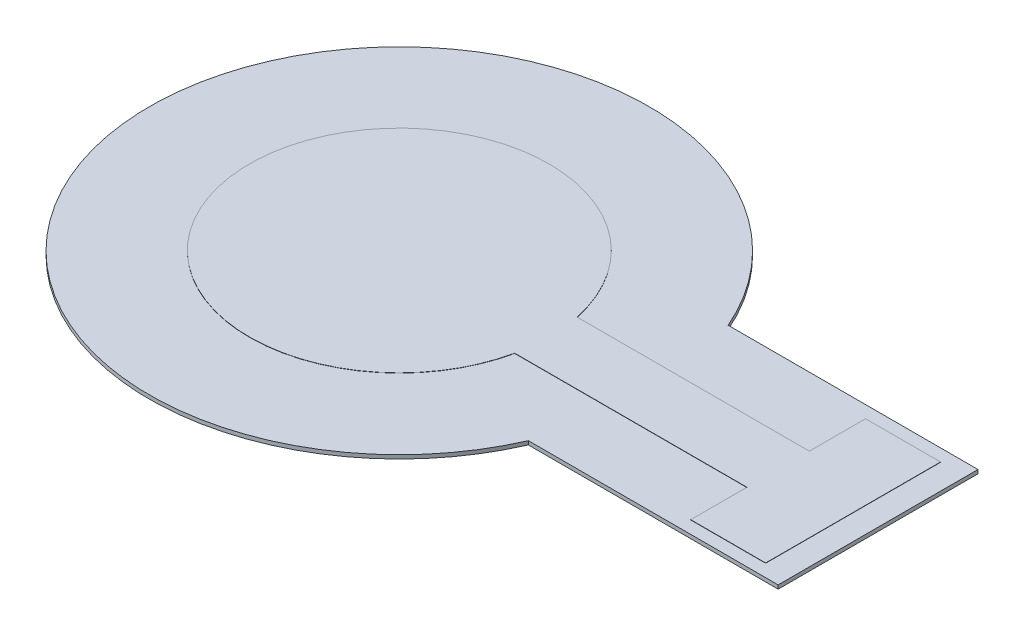
ISO-10303-21;
HEADER;
FILE_DESCRIPTION(('STEP AP214'),'2;1');
FILE_NAME('part.step','',(''),(''),'','','');
FILE_SCHEMA(('AUTOMOTIVE_DESIGN { 1 0 10303 214 1 1 1 1 }'));
ENDSEC;
DATA;
#1=APPLICATION_CONTEXT('core data for automotive mechanical design processes');
#2=APPLICATION_PROTOCOL_DEFINITION('international standard','automotive_design',2000,#1);
#3=PRODUCT_CONTEXT('',#1,'mechanical');
#4=PRODUCT('Part','Part','',(#3));
#5=PRODUCT_RELATED_PRODUCT_CATEGORY('part','',(#4));
#6=PRODUCT_DEFINITION_FORMATION('','',#4);
#7=PRODUCT_DEFINITION_CONTEXT('part definition',#1,'design');
#8=PRODUCT_DEFINITION('design','',#6,#7);
#9=PRODUCT_DEFINITION_SHAPE('','',#8);
#10=(LENGTH_UNIT() NAMED_UNIT(*) SI_UNIT(.MILLI.,.METRE.));
#11=(NAMED_UNIT(*) PLANE_ANGLE_UNIT() SI_UNIT($,.RADIAN.));
#12=(NAMED_UNIT(*) SI_UNIT($,.STERADIAN.) SOLID_ANGLE_UNIT());
#13=UNCERTAINTY_MEASURE_WITH_UNIT(LENGTH_MEASURE(1.E-05),#10,'distance_accuracy_value','');
#14=(GEOMETRIC_REPRESENTATION_CONTEXT(3) GLOBAL_UNCERTAINTY_ASSIGNED_CONTEXT((#13)) GLOBAL_UNIT_ASSIGNED_CONTEXT((#10,
#11,#12)) REPRESENTATION_CONTEXT('',''));
#15=CARTESIAN_POINT('',(0.,0.,0.));
#16=DIRECTION('',(0.,0.,1.));
#17=DIRECTION('',(1.,0.,0.));
#18=AXIS2_PLACEMENT_3D('',#15,#16,#17);
#19=CARTESIAN_POINT('',(0.,0.101,-248.70629343356));
#20=DIRECTION('',(0.,0.,-1.));
#21=DIRECTION('',(-1.,0.,0.));
#22=AXIS2_PLACEMENT_3D('',#19,#20,#21);
#23=PLANE('',#22);
#24=DIRECTION('',(0.,1.,0.));
#25=VECTOR('',#24,1.);
#26=CARTESIAN_POINT('',(24.4296262100537,0.101,-248.70629343356));
#27=LINE('',#26,#25);
#28=CARTESIAN_POINT('',(24.4296262100537,0.101,-248.70629343356));
#29=VERTEX_POINT('',#28);
#30=CARTESIAN_POINT('',(24.4296262100537,0.16,-248.70629343356));
#31=VERTEX_POINT('',#30);
#32=EDGE_CURVE('E48',#29,#31,#27,.T.);
#33=ORIENTED_EDGE('',*,*,#32,.T.);
#34=DIRECTION('',(-1.,0.,0.));
#35=VECTOR('',#34,1.);
#36=CARTESIAN_POINT('',(0.,0.16,-248.70629343356));
#37=LINE('',#36,#35);
#38=CARTESIAN_POINT('',(33.7264303028126,0.16,-248.70629343356));
#39=VERTEX_POINT('',#38);
#40=EDGE_CURVE('E109',#39,#31,#37,.T.);
#41=ORIENTED_EDGE('',*,*,#40,.F.);
#42=DIRECTION('',(0.,1.,0.));
#43=VECTOR('',#42,1.);
#44=CARTESIAN_POINT('',(33.7264303028126,0.101,-248.70629343356));
#45=LINE('',#44,#43);
#46=CARTESIAN_POINT('',(33.7264303028126,0.101,-248.70629343356));
#47=VERTEX_POINT('',#46);
#48=EDGE_CURVE('E12',#47,#39,#45,.T.);
#49=ORIENTED_EDGE('',*,*,#48,.F.);
#50=DIRECTION('',(-1.,0.,0.));
#51=VECTOR('',#50,1.);
#52=CARTESIAN_POINT('',(0.,0.101,-248.70629343356));
#53=LINE('',#52,#51);
#54=EDGE_CURVE('E110',#47,#29,#53,.T.);
#55=ORIENTED_EDGE('',*,*,#54,.T.);
#56=EDGE_LOOP('',(#33,#41,#49,#55));
#57=FACE_BOUND('',#56,.T.);
#58=ADVANCED_FACE('F45',(#57),#23,.T.);
#59=CARTESIAN_POINT('',(33.7264303028126,0.101,0.));
#60=DIRECTION('',(-1.,0.,0.));
#61=DIRECTION('',(0.,0.,1.));
#62=AXIS2_PLACEMENT_3D('',#59,#60,#61);
#63=PLANE('',#62);
#64=ORIENTED_EDGE('',*,*,#48,.T.);
#65=DIRECTION('',(0.,0.,1.));
#66=VECTOR('',#65,1.);
#67=CARTESIAN_POINT('',(33.7264303028126,0.16,0.));
#68=LINE('',#67,#66);
#69=CARTESIAN_POINT('',(33.7264303028126,0.16,-250.95629343356));
#70=VERTEX_POINT('',#69);
#71=EDGE_CURVE('E127',#70,#39,#68,.T.);
#72=ORIENTED_EDGE('',*,*,#71,.F.);
#73=DIRECTION('',(0.,1.,0.));
#74=VECTOR('',#73,1.);
#75=CARTESIAN_POINT('',(33.7264303028126,0.101,-250.95629343356));
#76=LINE('',#75,#74);
#77=CARTESIAN_POINT('',(33.7264303028126,0.101,-250.95629343356));
#78=VERTEX_POINT('',#77);
#79=EDGE_CURVE('E53',#78,#70,#76,.T.);
#80=ORIENTED_EDGE('',*,*,#79,.F.);
#81=DIRECTION('',(0.,0.,1.));
#82=VECTOR('',#81,1.);
#83=CARTESIAN_POINT('',(33.7264303028126,0.101,0.));
#84=LINE('',#83,#82);
#85=EDGE_CURVE('E115',#78,#47,#84,.T.);
#86=ORIENTED_EDGE('',*,*,#85,.T.);
#87=EDGE_LOOP('',(#64,#72,#80,#86));
#88=FACE_BOUND('',#87,.T.);
#89=ADVANCED_FACE('F191',(#88),#63,.T.);
#90=CARTESIAN_POINT('',(0.,0.101,-250.95629343356));
#91=DIRECTION('',(0.,0.,-1.));
#92=DIRECTION('',(-1.,0.,0.));
#93=AXIS2_PLACEMENT_3D('',#90,#91,#92);
#94=PLANE('',#93);
#95=ORIENTED_EDGE('',*,*,#79,.T.);
#96=DIRECTION('',(-1.,0.,0.));
#97=VECTOR('',#96,1.);
#98=CARTESIAN_POINT('',(0.,0.16,-250.95629343356));
#99=LINE('',#98,#97);
#100=CARTESIAN_POINT('',(36.7264303028126,0.16,-250.95629343356));
#101=VERTEX_POINT('',#100);
#102=EDGE_CURVE('E140',#101,#70,#99,.T.);
#103=ORIENTED_EDGE('',*,*,#102,.F.);
#104=DIRECTION('',(0.,1.,0.));
#105=VECTOR('',#104,1.);
#106=CARTESIAN_POINT('',(36.7264303028126,0.101,-250.95629343356));
#107=LINE('',#106,#105);
#108=CARTESIAN_POINT('',(36.7264303028126,0.101,-250.95629343356));
#109=VERTEX_POINT('',#108);
#110=EDGE_CURVE('E162',#109,#101,#107,.T.);
#111=ORIENTED_EDGE('',*,*,#110,.F.);
#112=DIRECTION('',(-1.,0.,0.));
#113=VECTOR('',#112,1.);
#114=CARTESIAN_POINT('',(0.,0.101,-250.95629343356));
#115=LINE('',#114,#113);
#116=EDGE_CURVE('E158',#109,#78,#115,.T.);
#117=ORIENTED_EDGE('',*,*,#116,.T.);
#118=EDGE_LOOP('',(#95,#103,#111,#117));
#119=FACE_BOUND('',#118,.T.);
#120=ADVANCED_FACE('F190',(#119),#94,.T.);
#121=CARTESIAN_POINT('',(36.7264303028124,0.101,0.));
#122=DIRECTION('',(1.,0.,0.));
#123=DIRECTION('',(0.,0.,-1.));
#124=AXIS2_PLACEMENT_3D('',#121,#122,#123);
#125=PLANE('',#124);
#126=ORIENTED_EDGE('',*,*,#110,.T.);
#127=DIRECTION('',(0.,0.,-1.));
#128=VECTOR('',#127,1.);
#129=CARTESIAN_POINT('',(36.7264303028124,0.16,0.));
#130=LINE('',#129,#128);
#131=CARTESIAN_POINT('',(36.7264303028126,0.16,-243.95629343356));
#132=VERTEX_POINT('',#131);
#133=EDGE_CURVE('E137',#132,#101,#130,.T.);
#134=ORIENTED_EDGE('',*,*,#133,.F.);
#135=DIRECTION('',(0.,1.,0.));
#136=VECTOR('',#135,1.);
#137=CARTESIAN_POINT('',(36.7264303028126,0.101,-243.95629343356));
#138=LINE('',#137,#136);
#139=CARTESIAN_POINT('',(36.7264303028126,0.101,-243.95629343356));
#140=VERTEX_POINT('',#139);
#141=EDGE_CURVE('E164',#140,#132,#138,.T.);
#142=ORIENTED_EDGE('',*,*,#141,.F.);
#143=DIRECTION('',(0.,0.,-1.));
#144=VECTOR('',#143,1.);
#145=CARTESIAN_POINT('',(36.7264303028124,0.101,0.));
#146=LINE('',#145,#144);
#147=EDGE_CURVE('E155',#140,#109,#146,.T.);
#148=ORIENTED_EDGE('',*,*,#147,.T.);
#149=EDGE_LOOP('',(#126,#134,#142,#148));
#150=FACE_BOUND('',#149,.T.);
#151=ADVANCED_FACE('F186',(#150),#125,.T.);
#152=CARTESIAN_POINT('',(0.,0.101,-243.95629343356));
#153=DIRECTION('',(0.,0.,1.));
#154=DIRECTION('',(1.,0.,0.));
#155=AXIS2_PLACEMENT_3D('',#152,#153,#154);
#156=PLANE('',#155);
#157=ORIENTED_EDGE('',*,*,#141,.T.);
#158=DIRECTION('',(1.,0.,0.));
#159=VECTOR('',#158,1.);
#160=CARTESIAN_POINT('',(0.,0.16,-243.95629343356));
#161=LINE('',#160,#159);
#162=CARTESIAN_POINT('',(33.7264303028126,0.16,-243.95629343356));
#163=VERTEX_POINT('',#162);
#164=EDGE_CURVE('E134',#163,#132,#161,.T.);
#165=ORIENTED_EDGE('',*,*,#164,.F.);
#166=DIRECTION('',(0.,1.,0.));
#167=VECTOR('',#166,1.);
#168=CARTESIAN_POINT('',(33.7264303028126,0.101,-243.95629343356));
#169=LINE('',#168,#167);
#170=CARTESIAN_POINT('',(33.7264303028126,0.101,-243.95629343356));
#171=VERTEX_POINT('',#170);
#172=EDGE_CURVE('E166',#171,#163,#169,.T.);
#173=ORIENTED_EDGE('',*,*,#172,.F.);
#174=DIRECTION('',(1.,0.,0.));
#175=VECTOR('',#174,1.);
#176=CARTESIAN_POINT('',(0.,0.101,-243.95629343356));
#177=LINE('',#176,#175);
#178=EDGE_CURVE('E152',#171,#140,#177,.T.);
#179=ORIENTED_EDGE('',*,*,#178,.T.);
#180=EDGE_LOOP('',(#157,#165,#173,#179));
#181=FACE_BOUND('',#180,.T.);
#182=ADVANCED_FACE('F179',(#181),#156,.T.);
#183=CARTESIAN_POINT('',(33.7264303028126,0.101,0.));
#184=DIRECTION('',(-1.,0.,0.));
#185=DIRECTION('',(0.,0.,1.));
#186=AXIS2_PLACEMENT_3D('',#183,#184,#185);
#187=PLANE('',#186);
#188=ORIENTED_EDGE('',*,*,#172,.T.);
#189=DIRECTION('',(0.,0.,1.));
#190=VECTOR('',#189,1.);
#191=CARTESIAN_POINT('',(33.7264303028126,0.16,0.));
#192=LINE('',#191,#190);
#193=CARTESIAN_POINT('',(33.7264303028126,0.16,-246.20629343356));
#194=VERTEX_POINT('',#193);
#195=EDGE_CURVE('E131',#194,#163,#192,.T.);
#196=ORIENTED_EDGE('',*,*,#195,.F.);
#197=DIRECTION('',(0.,1.,0.));
#198=VECTOR('',#197,1.);
#199=CARTESIAN_POINT('',(33.7264303028126,0.101,-246.20629343356));
#200=LINE('',#199,#198);
#201=CARTESIAN_POINT('',(33.7264303028126,0.101,-246.20629343356));
#202=VERTEX_POINT('',#201);
#203=EDGE_CURVE('E168',#202,#194,#200,.T.);
#204=ORIENTED_EDGE('',*,*,#203,.F.);
#205=DIRECTION('',(0.,0.,1.));
#206=VECTOR('',#205,1.);
#207=CARTESIAN_POINT('',(33.7264303028126,0.101,0.));
#208=LINE('',#207,#206);
#209=EDGE_CURVE('E149',#202,#171,#208,.T.);
#210=ORIENTED_EDGE('',*,*,#209,.T.);
#211=EDGE_LOOP('',(#188,#196,#204,#210));
#212=FACE_BOUND('',#211,.T.);
#213=ADVANCED_FACE('F176',(#212),#187,.T.);
#214=CARTESIAN_POINT('',(0.,0.101,-246.20629343356));
#215=DIRECTION('',(0.,0.,1.));
#216=DIRECTION('',(1.,0.,0.));
#217=AXIS2_PLACEMENT_3D('',#214,#215,#216);
#218=PLANE('',#217);
#219=ORIENTED_EDGE('',*,*,#203,.T.);
#220=DIRECTION('',(1.,0.,0.));
#221=VECTOR('',#220,1.);
#222=CARTESIAN_POINT('',(0.,0.16,-246.20629343356));
#223=LINE('',#222,#221);
#224=CARTESIAN_POINT('',(24.4296262100537,0.16,-246.20629343356));
#225=VERTEX_POINT('',#224);
#226=EDGE_CURVE('E122',#225,#194,#223,.T.);
#227=ORIENTED_EDGE('',*,*,#226,.F.);
#228=DIRECTION('',(0.,1.,0.));
#229=VECTOR('',#228,1.);
#230=CARTESIAN_POINT('',(24.4296262100537,0.101,-246.20629343356));
#231=LINE('',#230,#229);
#232=CARTESIAN_POINT('',(24.4296262100537,0.101,-246.20629343356));
#233=VERTEX_POINT('',#232);
#234=EDGE_CURVE('E114',#233,#225,#231,.T.);
#235=ORIENTED_EDGE('',*,*,#234,.F.);
#236=DIRECTION('',(1.,0.,0.));
#237=VECTOR('',#236,1.);
#238=CARTESIAN_POINT('',(0.,0.101,-246.20629343356));
#239=LINE('',#238,#237);
#240=EDGE_CURVE('E146',#233,#202,#239,.T.);
#241=ORIENTED_EDGE('',*,*,#240,.T.);
#242=EDGE_LOOP('',(#219,#227,#235,#241));
#243=FACE_BOUND('',#242,.T.);
#244=ADVANCED_FACE('F170',(#243),#218,.T.);
#245=CARTESIAN_POINT('',(18.5612789129009,0.101,-247.45629343356));
#246=DIRECTION('',(0.,1.,0.));
#247=DIRECTION('',(0.,0.,1.));
#248=AXIS2_PLACEMENT_3D('',#245,#246,#247);
#249=CYLINDRICAL_SURFACE('',#248,6.);
#250=ORIENTED_EDGE('',*,*,#234,.T.);
#251=CARTESIAN_POINT('',(18.5612789129009,0.16,-247.45629343356));
#252=DIRECTION('',(0.,1.,0.));
#253=DIRECTION('',(0.,0.,1.));
#254=AXIS2_PLACEMENT_3D('',#251,#252,#253);
#255=CIRCLE('',#254,6.);
#256=EDGE_CURVE('E117',#31,#225,#255,.T.);
#257=ORIENTED_EDGE('',*,*,#256,.F.);
#258=ORIENTED_EDGE('',*,*,#32,.F.);
#259=CARTESIAN_POINT('',(18.5612789129009,0.101,-247.45629343356));
#260=DIRECTION('',(0.,1.,0.));
#261=DIRECTION('',(0.,0.,1.));
#262=AXIS2_PLACEMENT_3D('',#259,#260,#261);
#263=CIRCLE('',#262,6.);
#264=EDGE_CURVE('E144',#29,#233,#263,.T.);
#265=ORIENTED_EDGE('',*,*,#264,.T.);
#266=EDGE_LOOP('',(#250,#257,#258,#265));
#267=FACE_BOUND('',#266,.T.);
#268=ADVANCED_FACE('F118',(#267),#249,.T.);
#269=CARTESIAN_POINT('',(0.,0.101,0.));
#270=DIRECTION('',(0.,1.,0.));
#271=DIRECTION('',(0.,0.,1.));
#272=AXIS2_PLACEMENT_3D('',#269,#270,#271);
#273=PLANE('',#272);
#274=ORIENTED_EDGE('',*,*,#54,.F.);
#275=ORIENTED_EDGE('',*,*,#85,.F.);
#276=ORIENTED_EDGE('',*,*,#116,.F.);
#277=ORIENTED_EDGE('',*,*,#147,.F.);
#278=ORIENTED_EDGE('',*,*,#178,.F.);
#279=ORIENTED_EDGE('',*,*,#209,.F.);
#280=ORIENTED_EDGE('',*,*,#240,.F.);
#281=ORIENTED_EDGE('',*,*,#264,.F.);
#282=EDGE_LOOP('',(#274,#275,#276,#277,#278,#279,#280,#281));
#283=FACE_BOUND('',#282,.T.);
#284=ADVANCED_FACE('F182',(#283),#273,.F.);
#285=CARTESIAN_POINT('',(0.,0.16,0.));
#286=DIRECTION('',(0.,1.,0.));
#287=DIRECTION('',(0.,0.,1.));
#288=AXIS2_PLACEMENT_3D('',#285,#286,#287);
#289=PLANE('',#288);
#290=ORIENTED_EDGE('',*,*,#40,.T.);
#291=ORIENTED_EDGE('',*,*,#256,.T.);
#292=ORIENTED_EDGE('',*,*,#226,.T.);
#293=ORIENTED_EDGE('',*,*,#195,.T.);
#294=ORIENTED_EDGE('',*,*,#164,.T.);
#295=ORIENTED_EDGE('',*,*,#133,.T.);
#296=ORIENTED_EDGE('',*,*,#102,.T.);
#297=ORIENTED_EDGE('',*,*,#71,.T.);
#298=EDGE_LOOP('',(#290,#291,#292,#293,#294,#295,#296,#297));
#299=FACE_BOUND('',#298,.T.);
#300=ADVANCED_FACE('F125',(#299),#289,.T.);
#301=CLOSED_SHELL('',(#58,#89,#120,#151,#182,#213,#244,#268,#284,#300));
#302=MANIFOLD_SOLID_BREP('B2',#301);
#303=CARTESIAN_POINT('',(37.7264303028128,0.15,0.));
#304=DIRECTION('',(-1.,0.,0.));
#305=DIRECTION('',(0.,0.,1.));
#306=AXIS2_PLACEMENT_3D('',#303,#304,#305);
#307=PLANE('',#306);
#308=DIRECTION('',(0.,0.,-1.));
#309=VECTOR('',#308,1.);
#310=CARTESIAN_POINT('',(37.7264303028128,0.,0.));
#311=LINE('',#310,#309);
#312=CARTESIAN_POINT('',(37.7264303028126,0.,-243.45629343356));
#313=VERTEX_POINT('',#312);
#314=CARTESIAN_POINT('',(37.7264303028126,0.,-251.45629343356));
#315=VERTEX_POINT('',#314);
#316=EDGE_CURVE('E342',#313,#315,#311,.T.);
#317=ORIENTED_EDGE('',*,*,#316,.T.);
#318=DIRECTION('',(0.,-1.,0.));
#319=VECTOR('',#318,1.);
#320=CARTESIAN_POINT('',(37.7264303028126,0.15,-251.45629343356));
#321=LINE('',#320,#319);
#322=CARTESIAN_POINT('',(37.7264303028126,0.15,-251.45629343356));
#323=VERTEX_POINT('',#322);
#324=EDGE_CURVE('E43',#323,#315,#321,.T.);
#325=ORIENTED_EDGE('',*,*,#324,.F.);
#326=DIRECTION('',(0.,0.,-1.));
#327=VECTOR('',#326,1.);
#328=CARTESIAN_POINT('',(37.7264303028128,0.15,0.));
#329=LINE('',#328,#327);
#330=CARTESIAN_POINT('',(37.7264303028126,0.15,-243.45629343356));
#331=VERTEX_POINT('',#330);
#332=EDGE_CURVE('E330',#331,#323,#329,.T.);
#333=ORIENTED_EDGE('',*,*,#332,.F.);
#334=DIRECTION('',(0.,-1.,0.));
#335=VECTOR('',#334,1.);
#336=CARTESIAN_POINT('',(37.7264303028126,0.15,-243.45629343356));
#337=LINE('',#336,#335);
#338=EDGE_CURVE('E338',#331,#313,#337,.T.);
#339=ORIENTED_EDGE('',*,*,#338,.T.);
#340=EDGE_LOOP('',(#317,#325,#333,#339));
#341=FACE_BOUND('',#340,.T.);
#342=ADVANCED_FACE('F279',(#341),#307,.F.);
#343=CARTESIAN_POINT('',(0.,0.15,-251.45629343356));
#344=DIRECTION('',(0.,0.,1.));
#345=DIRECTION('',(1.,0.,0.));
#346=AXIS2_PLACEMENT_3D('',#343,#344,#345);
#347=PLANE('',#346);
#348=DIRECTION('',(-1.,0.,0.));
#349=VECTOR('',#348,1.);
#350=CARTESIAN_POINT('',(0.,0.,-251.45629343356));
#351=LINE('',#350,#349);
#352=CARTESIAN_POINT('',(27.7264303028126,0.,-251.45629343356));
#353=VERTEX_POINT('',#352);
#354=EDGE_CURVE('E334',#315,#353,#351,.T.);
#355=ORIENTED_EDGE('',*,*,#354,.T.);
#356=DIRECTION('',(0.,-1.,0.));
#357=VECTOR('',#356,1.);
#358=CARTESIAN_POINT('',(27.7264303028126,0.15,-251.45629343356));
#359=LINE('',#358,#357);
#360=CARTESIAN_POINT('',(27.7264303028126,0.15,-251.45629343356));
#361=VERTEX_POINT('',#360);
#362=EDGE_CURVE('E287',#361,#353,#359,.T.);
#363=ORIENTED_EDGE('',*,*,#362,.F.);
#364=DIRECTION('',(-1.,0.,0.));
#365=VECTOR('',#364,1.);
#366=CARTESIAN_POINT('',(0.,0.15,-251.45629343356));
#367=LINE('',#366,#365);
#368=EDGE_CURVE('E325',#323,#361,#367,.T.);
#369=ORIENTED_EDGE('',*,*,#368,.F.);
#370=ORIENTED_EDGE('',*,*,#324,.T.);
#371=EDGE_LOOP('',(#355,#363,#369,#370));
#372=FACE_BOUND('',#371,.T.);
#373=ADVANCED_FACE('F333',(#372),#347,.F.);
#374=CARTESIAN_POINT('',(18.5612789129009,0.15,-247.45629343356));
#375=DIRECTION('',(0.,-1.,0.));
#376=DIRECTION('',(0.,0.,-1.));
#377=AXIS2_PLACEMENT_3D('',#374,#375,#376);
#378=CYLINDRICAL_SURFACE('',#377,10.);
#379=CARTESIAN_POINT('',(18.5612789129009,0.,-247.45629343356));
#380=DIRECTION('',(0.,1.,0.));
#381=DIRECTION('',(0.,0.,1.));
#382=AXIS2_PLACEMENT_3D('',#379,#380,#381);
#383=CIRCLE('',#382,10.);
#384=CARTESIAN_POINT('',(27.7264303028126,0.,-243.45629343356));
#385=VERTEX_POINT('',#384);
#386=EDGE_CURVE('E312',#353,#385,#383,.T.);
#387=ORIENTED_EDGE('',*,*,#386,.T.);
#388=DIRECTION('',(0.,-1.,0.));
#389=VECTOR('',#388,1.);
#390=CARTESIAN_POINT('',(27.7264303028126,0.15,-243.45629343356));
#391=LINE('',#390,#389);
#392=CARTESIAN_POINT('',(27.7264303028126,0.15,-243.45629343356));
#393=VERTEX_POINT('',#392);
#394=EDGE_CURVE('E335',#393,#385,#391,.T.);
#395=ORIENTED_EDGE('',*,*,#394,.F.);
#396=CARTESIAN_POINT('',(18.5612789129009,0.15,-247.45629343356));
#397=DIRECTION('',(0.,1.,0.));
#398=DIRECTION('',(0.,0.,1.));
#399=AXIS2_PLACEMENT_3D('',#396,#397,#398);
#400=CIRCLE('',#399,10.);
#401=EDGE_CURVE('E328',#361,#393,#400,.T.);
#402=ORIENTED_EDGE('',*,*,#401,.F.);
#403=ORIENTED_EDGE('',*,*,#362,.T.);
#404=EDGE_LOOP('',(#387,#395,#402,#403));
#405=FACE_BOUND('',#404,.T.);
#406=ADVANCED_FACE('F336',(#405),#378,.T.);
#407=CARTESIAN_POINT('',(6.75726956149591E-13,0.15,-243.45629343356));
#408=DIRECTION('',(0.,0.,-1.));
#409=DIRECTION('',(-1.,0.,0.));
#410=AXIS2_PLACEMENT_3D('',#407,#408,#409);
#411=PLANE('',#410);
#412=DIRECTION('',(1.,0.,0.));
#413=VECTOR('',#412,1.);
#414=CARTESIAN_POINT('',(6.75726956149591E-13,0.,-243.45629343356));
#415=LINE('',#414,#413);
#416=EDGE_CURVE('E318',#385,#313,#415,.T.);
#417=ORIENTED_EDGE('',*,*,#416,.T.);
#418=ORIENTED_EDGE('',*,*,#338,.F.);
#419=DIRECTION('',(1.,0.,0.));
#420=VECTOR('',#419,1.);
#421=CARTESIAN_POINT('',(6.75726956149591E-13,0.15,-243.45629343356));
#422=LINE('',#421,#420);
#423=EDGE_CURVE('E295',#393,#331,#422,.T.);
#424=ORIENTED_EDGE('',*,*,#423,.F.);
#425=ORIENTED_EDGE('',*,*,#394,.T.);
#426=EDGE_LOOP('',(#417,#418,#424,#425));
#427=FACE_BOUND('',#426,.T.);
#428=ADVANCED_FACE('F349',(#427),#411,.F.);
#429=CARTESIAN_POINT('',(0.,0.15,0.));
#430=DIRECTION('',(0.,1.,0.));
#431=DIRECTION('',(0.,0.,1.));
#432=AXIS2_PLACEMENT_3D('',#429,#430,#431);
#433=PLANE('',#432);
#434=ORIENTED_EDGE('',*,*,#332,.T.);
#435=ORIENTED_EDGE('',*,*,#368,.T.);
#436=ORIENTED_EDGE('',*,*,#401,.T.);
#437=ORIENTED_EDGE('',*,*,#423,.T.);
#438=EDGE_LOOP('',(#434,#435,#436,#437));
#439=FACE_BOUND('',#438,.T.);
#440=ADVANCED_FACE('F326',(#439),#433,.T.);
#441=CARTESIAN_POINT('',(0.,0.,0.));
#442=DIRECTION('',(0.,1.,0.));
#443=DIRECTION('',(0.,0.,1.));
#444=AXIS2_PLACEMENT_3D('',#441,#442,#443);
#445=PLANE('',#444);
#446=ORIENTED_EDGE('',*,*,#316,.F.);
#447=ORIENTED_EDGE('',*,*,#416,.F.);
#448=ORIENTED_EDGE('',*,*,#386,.F.);
#449=ORIENTED_EDGE('',*,*,#354,.F.);
#450=EDGE_LOOP('',(#446,#447,#448,#449));
#451=FACE_BOUND('',#450,.T.);
#452=ADVANCED_FACE('F352',(#451),#445,.F.);
#453=CLOSED_SHELL('',(#342,#373,#406,#428,#440,#452));
#454=MANIFOLD_SOLID_BREP('B6',#453);
#455=ADVANCED_BREP_SHAPE_REPRESENTATION('',(#18,#302,#454),#14);
#456=SHAPE_DEFINITION_REPRESENTATION(#9,#455);
ENDSEC;
END-ISO-10303-21;
